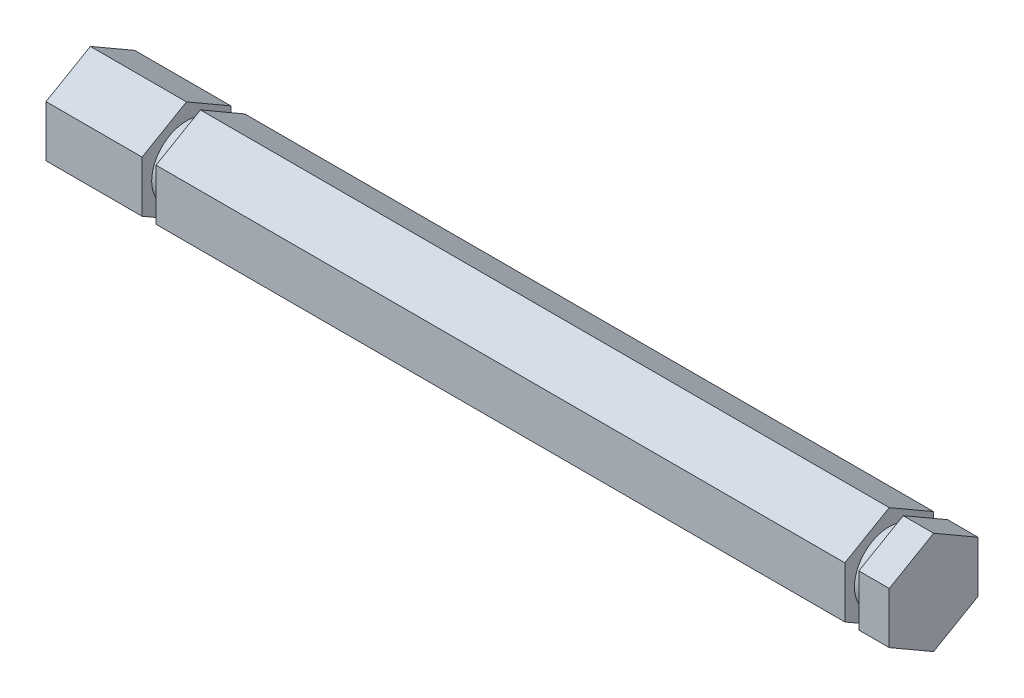
ISO-10303-21;
HEADER;
FILE_DESCRIPTION(('STEP AP214'),'2;1');
FILE_NAME('part.step','',(''),(''),'','','');
FILE_SCHEMA(('AUTOMOTIVE_DESIGN { 1 0 10303 214 1 1 1 1 }'));
ENDSEC;
DATA;
#1=APPLICATION_CONTEXT('core data for automotive mechanical design processes');
#2=APPLICATION_PROTOCOL_DEFINITION('international standard','automotive_design',2000,#1);
#3=PRODUCT_CONTEXT('',#1,'mechanical');
#4=PRODUCT('Part','Part','',(#3));
#5=PRODUCT_RELATED_PRODUCT_CATEGORY('part','',(#4));
#6=PRODUCT_DEFINITION_FORMATION('','',#4);
#7=PRODUCT_DEFINITION_CONTEXT('part definition',#1,'design');
#8=PRODUCT_DEFINITION('design','',#6,#7);
#9=PRODUCT_DEFINITION_SHAPE('','',#8);
#10=(LENGTH_UNIT() NAMED_UNIT(*) SI_UNIT(.MILLI.,.METRE.));
#11=(NAMED_UNIT(*) PLANE_ANGLE_UNIT() SI_UNIT($,.RADIAN.));
#12=(NAMED_UNIT(*) SI_UNIT($,.STERADIAN.) SOLID_ANGLE_UNIT());
#13=UNCERTAINTY_MEASURE_WITH_UNIT(LENGTH_MEASURE(1.E-05),#10,'distance_accuracy_value','');
#14=(GEOMETRIC_REPRESENTATION_CONTEXT(3) GLOBAL_UNCERTAINTY_ASSIGNED_CONTEXT((#13)) GLOBAL_UNIT_ASSIGNED_CONTEXT((#10,
#11,#12)) REPRESENTATION_CONTEXT('',''));
#15=CARTESIAN_POINT('',(0.,0.,0.));
#16=DIRECTION('',(0.,0.,1.));
#17=DIRECTION('',(1.,0.,0.));
#18=AXIS2_PLACEMENT_3D('',#15,#16,#17);
#19=CARTESIAN_POINT('',(120.65,3.6661742093542,-6.34999999999996));
#20=DIRECTION('',(0.,-0.866025403784441,0.499999999999995));
#21=DIRECTION('',(0.,-0.499999999999995,-0.866025403784442));
#22=AXIS2_PLACEMENT_3D('',#19,#20,#21);
#23=PLANE('',#22);
#24=DIRECTION('',(0.,-0.499999999999995,-0.866025403784442));
#25=VECTOR('',#24,1.);
#26=CARTESIAN_POINT('',(116.3,3.6661742093542,-6.34999999999996));
#27=LINE('',#26,#25);
#28=CARTESIAN_POINT('',(116.3,7.33234841870825,0.));
#29=VERTEX_POINT('',#28);
#30=CARTESIAN_POINT('',(116.3,3.6661742093542,-6.34999999999996));
#31=VERTEX_POINT('',#30);
#32=EDGE_CURVE('E366',#29,#31,#27,.T.);
#33=ORIENTED_EDGE('',*,*,#32,.F.);
#34=DIRECTION('',(-1.,0.,0.));
#35=VECTOR('',#34,1.);
#36=CARTESIAN_POINT('',(120.65,7.33234841870825,0.));
#37=LINE('',#36,#35);
#38=CARTESIAN_POINT('',(120.65,7.33234841870825,0.));
#39=VERTEX_POINT('',#38);
#40=EDGE_CURVE('E251',#39,#29,#37,.T.);
#41=ORIENTED_EDGE('',*,*,#40,.F.);
#42=DIRECTION('',(0.,0.499999999999995,0.866025403784441));
#43=VECTOR('',#42,1.);
#44=CARTESIAN_POINT('',(120.65,3.6661742093542,-6.34999999999996));
#45=LINE('',#44,#43);
#46=CARTESIAN_POINT('',(120.65,3.6661742093542,-6.34999999999996));
#47=VERTEX_POINT('',#46);
#48=EDGE_CURVE('E356',#47,#39,#45,.T.);
#49=ORIENTED_EDGE('',*,*,#48,.F.);
#50=DIRECTION('',(-1.,0.,0.));
#51=VECTOR('',#50,1.);
#52=CARTESIAN_POINT('',(120.65,3.6661742093542,-6.34999999999996));
#53=LINE('',#52,#51);
#54=EDGE_CURVE('E297',#47,#31,#53,.T.);
#55=ORIENTED_EDGE('',*,*,#54,.T.);
#56=EDGE_LOOP('',(#33,#41,#49,#55));
#57=FACE_BOUND('',#56,.T.);
#58=ADVANCED_FACE('F48',(#57),#23,.F.);
#59=CARTESIAN_POINT('',(120.65,7.33234841870825,0.));
#60=DIRECTION('',(0.,-0.866025403784438,-0.500000000000001));
#61=DIRECTION('',(0.,0.500000000000001,-0.866025403784438));
#62=AXIS2_PLACEMENT_3D('',#59,#60,#61);
#63=PLANE('',#62);
#64=DIRECTION('',(0.,0.500000000000001,-0.866025403784438));
#65=VECTOR('',#64,1.);
#66=CARTESIAN_POINT('',(116.3,7.33234841870825,0.));
#67=LINE('',#66,#65);
#68=CARTESIAN_POINT('',(116.3,3.66617420935411,6.35000000000001));
#69=VERTEX_POINT('',#68);
#70=EDGE_CURVE('E386',#69,#29,#67,.T.);
#71=ORIENTED_EDGE('',*,*,#70,.F.);
#72=DIRECTION('',(-1.,0.,0.));
#73=VECTOR('',#72,1.);
#74=CARTESIAN_POINT('',(120.65,3.66617420935411,6.35000000000001));
#75=LINE('',#74,#73);
#76=CARTESIAN_POINT('',(120.65,3.66617420935411,6.35000000000001));
#77=VERTEX_POINT('',#76);
#78=EDGE_CURVE('E230',#77,#69,#75,.T.);
#79=ORIENTED_EDGE('',*,*,#78,.F.);
#80=DIRECTION('',(0.,-0.500000000000001,0.866025403784438));
#81=VECTOR('',#80,1.);
#82=CARTESIAN_POINT('',(120.65,7.33234841870825,0.));
#83=LINE('',#82,#81);
#84=EDGE_CURVE('E378',#39,#77,#83,.T.);
#85=ORIENTED_EDGE('',*,*,#84,.F.);
#86=ORIENTED_EDGE('',*,*,#40,.T.);
#87=EDGE_LOOP('',(#71,#79,#85,#86));
#88=FACE_BOUND('',#87,.T.);
#89=ADVANCED_FACE('F464',(#88),#63,.F.);
#90=CARTESIAN_POINT('',(120.65,3.66617420935411,6.35000000000001));
#91=DIRECTION('',(0.,0.,-1.));
#92=DIRECTION('',(0.,1.,0.));
#93=AXIS2_PLACEMENT_3D('',#90,#91,#92);
#94=PLANE('',#93);
#95=DIRECTION('',(0.,1.,0.));
#96=VECTOR('',#95,1.);
#97=CARTESIAN_POINT('',(116.3,3.66617420935411,6.35000000000001));
#98=LINE('',#97,#96);
#99=CARTESIAN_POINT('',(116.3,-3.66617420935415,6.34999999999999));
#100=VERTEX_POINT('',#99);
#101=EDGE_CURVE('E389',#100,#69,#98,.T.);
#102=ORIENTED_EDGE('',*,*,#101,.F.);
#103=DIRECTION('',(-1.,0.,0.));
#104=VECTOR('',#103,1.);
#105=CARTESIAN_POINT('',(120.65,-3.66617420935416,6.34999999999999));
#106=LINE('',#105,#104);
#107=CARTESIAN_POINT('',(120.65,-3.66617420935416,6.34999999999999));
#108=VERTEX_POINT('',#107);
#109=EDGE_CURVE('E228',#108,#100,#106,.T.);
#110=ORIENTED_EDGE('',*,*,#109,.F.);
#111=DIRECTION('',(0.,-1.,0.));
#112=VECTOR('',#111,1.);
#113=CARTESIAN_POINT('',(120.65,3.66617420935411,6.35000000000001));
#114=LINE('',#113,#112);
#115=EDGE_CURVE('E375',#77,#108,#114,.T.);
#116=ORIENTED_EDGE('',*,*,#115,.F.);
#117=ORIENTED_EDGE('',*,*,#78,.T.);
#118=EDGE_LOOP('',(#102,#110,#116,#117));
#119=FACE_BOUND('',#118,.T.);
#120=ADVANCED_FACE('F471',(#119),#94,.F.);
#121=CARTESIAN_POINT('',(120.65,-3.66617420935416,6.34999999999999));
#122=DIRECTION('',(0.,0.866025403784442,-0.499999999999995));
#123=DIRECTION('',(0.,0.499999999999995,0.866025403784442));
#124=AXIS2_PLACEMENT_3D('',#121,#122,#123);
#125=PLANE('',#124);
#126=DIRECTION('',(0.,0.499999999999995,0.866025403784442));
#127=VECTOR('',#126,1.);
#128=CARTESIAN_POINT('',(116.3,-3.66617420935416,6.34999999999999));
#129=LINE('',#128,#127);
#130=CARTESIAN_POINT('',(116.3,-7.33234841870825,0.));
#131=VERTEX_POINT('',#130);
#132=EDGE_CURVE('E392',#131,#100,#129,.T.);
#133=ORIENTED_EDGE('',*,*,#132,.F.);
#134=DIRECTION('',(-1.,0.,0.));
#135=VECTOR('',#134,1.);
#136=CARTESIAN_POINT('',(120.65,-7.33234841870825,0.));
#137=LINE('',#136,#135);
#138=CARTESIAN_POINT('',(120.65,-7.33234841870825,0.));
#139=VERTEX_POINT('',#138);
#140=EDGE_CURVE('E317',#139,#131,#137,.T.);
#141=ORIENTED_EDGE('',*,*,#140,.F.);
#142=DIRECTION('',(0.,-0.499999999999995,-0.866025403784441));
#143=VECTOR('',#142,1.);
#144=CARTESIAN_POINT('',(120.65,-3.66617420935416,6.34999999999999));
#145=LINE('',#144,#143);
#146=EDGE_CURVE('E372',#108,#139,#145,.T.);
#147=ORIENTED_EDGE('',*,*,#146,.F.);
#148=ORIENTED_EDGE('',*,*,#109,.T.);
#149=EDGE_LOOP('',(#133,#141,#147,#148));
#150=FACE_BOUND('',#149,.T.);
#151=ADVANCED_FACE('F597',(#150),#125,.F.);
#152=CARTESIAN_POINT('',(120.65,-7.33234841870825,0.));
#153=DIRECTION('',(0.,0.866025403784435,0.500000000000007));
#154=DIRECTION('',(0.,-0.500000000000007,0.866025403784435));
#155=AXIS2_PLACEMENT_3D('',#152,#153,#154);
#156=PLANE('',#155);
#157=DIRECTION('',(0.,-0.500000000000007,0.866025403784435));
#158=VECTOR('',#157,1.);
#159=CARTESIAN_POINT('',(116.3,-7.33234841870825,0.));
#160=LINE('',#159,#158);
#161=CARTESIAN_POINT('',(116.3,-3.66617420935407,-6.35000000000004));
#162=VERTEX_POINT('',#161);
#163=EDGE_CURVE('E292',#162,#131,#160,.T.);
#164=ORIENTED_EDGE('',*,*,#163,.F.);
#165=DIRECTION('',(-1.,0.,0.));
#166=VECTOR('',#165,1.);
#167=CARTESIAN_POINT('',(120.65,-3.66617420935407,-6.35000000000004));
#168=LINE('',#167,#166);
#169=CARTESIAN_POINT('',(120.65,-3.66617420935407,-6.35000000000004));
#170=VERTEX_POINT('',#169);
#171=EDGE_CURVE('E311',#170,#162,#168,.T.);
#172=ORIENTED_EDGE('',*,*,#171,.F.);
#173=DIRECTION('',(0.,0.500000000000007,-0.866025403784435));
#174=VECTOR('',#173,1.);
#175=CARTESIAN_POINT('',(120.65,-7.33234841870825,0.));
#176=LINE('',#175,#174);
#177=EDGE_CURVE('E369',#139,#170,#176,.T.);
#178=ORIENTED_EDGE('',*,*,#177,.F.);
#179=ORIENTED_EDGE('',*,*,#140,.T.);
#180=EDGE_LOOP('',(#164,#172,#178,#179));
#181=FACE_BOUND('',#180,.T.);
#182=ADVANCED_FACE('F600',(#181),#156,.F.);
#183=CARTESIAN_POINT('',(120.65,-3.66617420935407,-6.35000000000004));
#184=DIRECTION('',(0.,0.,1.));
#185=DIRECTION('',(0.,-1.,0.));
#186=AXIS2_PLACEMENT_3D('',#183,#184,#185);
#187=PLANE('',#186);
#188=DIRECTION('',(0.,-1.,0.));
#189=VECTOR('',#188,1.);
#190=CARTESIAN_POINT('',(116.3,-3.66617420935407,-6.35000000000004));
#191=LINE('',#190,#189);
#192=EDGE_CURVE('E11',#31,#162,#191,.T.);
#193=ORIENTED_EDGE('',*,*,#192,.F.);
#194=ORIENTED_EDGE('',*,*,#54,.F.);
#195=DIRECTION('',(0.,1.,0.));
#196=VECTOR('',#195,1.);
#197=CARTESIAN_POINT('',(120.65,-3.66617420935407,-6.35000000000004));
#198=LINE('',#197,#196);
#199=EDGE_CURVE('E306',#170,#47,#198,.T.);
#200=ORIENTED_EDGE('',*,*,#199,.F.);
#201=ORIENTED_EDGE('',*,*,#171,.T.);
#202=EDGE_LOOP('',(#193,#194,#200,#201));
#203=FACE_BOUND('',#202,.T.);
#204=ADVANCED_FACE('F459',(#203),#187,.F.);
#205=CARTESIAN_POINT('',(120.65,0.,0.));
#206=DIRECTION('',(1.,0.,0.));
#207=DIRECTION('',(0.,0.,-1.));
#208=AXIS2_PLACEMENT_3D('',#205,#206,#207);
#209=PLANE('',#208);
#210=ORIENTED_EDGE('',*,*,#48,.T.);
#211=ORIENTED_EDGE('',*,*,#84,.T.);
#212=ORIENTED_EDGE('',*,*,#115,.T.);
#213=ORIENTED_EDGE('',*,*,#146,.T.);
#214=ORIENTED_EDGE('',*,*,#177,.T.);
#215=ORIENTED_EDGE('',*,*,#199,.T.);
#216=EDGE_LOOP('',(#210,#211,#212,#213,#214,#215));
#217=FACE_BOUND('',#216,.T.);
#218=ADVANCED_FACE('F605',(#217),#209,.T.);
#219=CARTESIAN_POINT('',(116.3,7.33234841870825,0.));
#220=DIRECTION('',(-1.,0.,0.));
#221=DIRECTION('',(0.,0.,1.));
#222=AXIS2_PLACEMENT_3D('',#219,#220,#221);
#223=PLANE('',#222);
#224=CARTESIAN_POINT('',(116.3,0.,0.));
#225=DIRECTION('',(-1.,0.,0.));
#226=DIRECTION('',(0.,0.,1.));
#227=AXIS2_PLACEMENT_3D('',#224,#225,#226);
#228=CIRCLE('',#227,4.9784);
#229=CARTESIAN_POINT('',(116.3,0.,4.9784));
#230=VERTEX_POINT('',#229);
#231=EDGE_CURVE('E428',#230,#230,#228,.T.);
#232=ORIENTED_EDGE('',*,*,#231,.F.);
#233=EDGE_LOOP('',(#232));
#234=FACE_BOUND('',#233,.T.);
#235=ORIENTED_EDGE('',*,*,#32,.T.);
#236=ORIENTED_EDGE('',*,*,#192,.T.);
#237=ORIENTED_EDGE('',*,*,#163,.T.);
#238=ORIENTED_EDGE('',*,*,#132,.T.);
#239=ORIENTED_EDGE('',*,*,#101,.T.);
#240=ORIENTED_EDGE('',*,*,#70,.T.);
#241=EDGE_LOOP('',(#235,#236,#237,#238,#239,#240));
#242=FACE_BOUND('',#241,.T.);
#243=ADVANCED_FACE('F460',(#234,#242),#223,.T.);
#244=CARTESIAN_POINT('',(114.3,7.33234841870825,0.));
#245=DIRECTION('',(1.,0.,0.));
#246=DIRECTION('',(0.,0.,-1.));
#247=AXIS2_PLACEMENT_3D('',#244,#245,#246);
#248=PLANE('',#247);
#249=CARTESIAN_POINT('',(114.3,0.,0.));
#250=DIRECTION('',(-1.,0.,0.));
#251=DIRECTION('',(0.,0.,1.));
#252=AXIS2_PLACEMENT_3D('',#249,#250,#251);
#253=CIRCLE('',#252,4.9784);
#254=CARTESIAN_POINT('',(114.3,0.,4.9784));
#255=VERTEX_POINT('',#254);
#256=EDGE_CURVE('E433',#255,#255,#253,.T.);
#257=ORIENTED_EDGE('',*,*,#256,.T.);
#258=EDGE_LOOP('',(#257));
#259=FACE_BOUND('',#258,.T.);
#260=DIRECTION('',(0.,0.499999999999995,0.866025403784442));
#261=VECTOR('',#260,1.);
#262=CARTESIAN_POINT('',(114.3,3.6661742093542,-6.34999999999996));
#263=LINE('',#262,#261);
#264=CARTESIAN_POINT('',(114.3,3.6661742093542,-6.34999999999996));
#265=VERTEX_POINT('',#264);
#266=CARTESIAN_POINT('',(114.3,7.33234841870825,0.));
#267=VERTEX_POINT('',#266);
#268=EDGE_CURVE('E279',#265,#267,#263,.T.);
#269=ORIENTED_EDGE('',*,*,#268,.T.);
#270=DIRECTION('',(0.,-0.500000000000001,0.866025403784438));
#271=VECTOR('',#270,1.);
#272=CARTESIAN_POINT('',(114.3,7.33234841870825,0.));
#273=LINE('',#272,#271);
#274=CARTESIAN_POINT('',(114.3,3.66617420935411,6.35000000000001));
#275=VERTEX_POINT('',#274);
#276=EDGE_CURVE('E293',#267,#275,#273,.T.);
#277=ORIENTED_EDGE('',*,*,#276,.T.);
#278=DIRECTION('',(0.,-1.,0.));
#279=VECTOR('',#278,1.);
#280=CARTESIAN_POINT('',(114.3,3.66617420935411,6.35000000000001));
#281=LINE('',#280,#279);
#282=CARTESIAN_POINT('',(114.3,-3.66617420935415,6.34999999999999));
#283=VERTEX_POINT('',#282);
#284=EDGE_CURVE('E399',#275,#283,#281,.T.);
#285=ORIENTED_EDGE('',*,*,#284,.T.);
#286=DIRECTION('',(0.,-0.499999999999995,-0.866025403784442));
#287=VECTOR('',#286,1.);
#288=CARTESIAN_POINT('',(114.3,-3.66617420935416,6.34999999999999));
#289=LINE('',#288,#287);
#290=CARTESIAN_POINT('',(114.3,-7.33234841870825,0.));
#291=VERTEX_POINT('',#290);
#292=EDGE_CURVE('E402',#283,#291,#289,.T.);
#293=ORIENTED_EDGE('',*,*,#292,.T.);
#294=DIRECTION('',(0.,0.500000000000007,-0.866025403784435));
#295=VECTOR('',#294,1.);
#296=CARTESIAN_POINT('',(114.3,-7.33234841870825,0.));
#297=LINE('',#296,#295);
#298=CARTESIAN_POINT('',(114.3,-3.66617420935407,-6.35000000000004));
#299=VERTEX_POINT('',#298);
#300=EDGE_CURVE('E77',#291,#299,#297,.T.);
#301=ORIENTED_EDGE('',*,*,#300,.T.);
#302=DIRECTION('',(0.,1.,0.));
#303=VECTOR('',#302,1.);
#304=CARTESIAN_POINT('',(114.3,-3.66617420935407,-6.35000000000004));
#305=LINE('',#304,#303);
#306=EDGE_CURVE('E56',#299,#265,#305,.T.);
#307=ORIENTED_EDGE('',*,*,#306,.T.);
#308=EDGE_LOOP('',(#269,#277,#285,#293,#301,#307));
#309=FACE_BOUND('',#308,.T.);
#310=ADVANCED_FACE('F278',(#259,#309),#248,.T.);
#311=CARTESIAN_POINT('',(0.,0.,0.));
#312=DIRECTION('',(-1.,0.,0.));
#313=DIRECTION('',(0.,0.,1.));
#314=AXIS2_PLACEMENT_3D('',#311,#312,#313);
#315=CYLINDRICAL_SURFACE('',#314,4.9784);
#316=ORIENTED_EDGE('',*,*,#231,.T.);
#317=EDGE_LOOP('',(#316));
#318=FACE_BOUND('',#317,.T.);
#319=ORIENTED_EDGE('',*,*,#256,.F.);
#320=EDGE_LOOP('',(#319));
#321=FACE_BOUND('',#320,.T.);
#322=ADVANCED_FACE('F448',(#318,#321),#315,.T.);
#323=ORIENTED_EDGE('',*,*,#306,.F.);
#324=CARTESIAN_POINT('',(15.748,-3.66617420935407,-6.35000000000004));
#325=VERTEX_POINT('',#324);
#326=EDGE_CURVE('E316',#299,#325,#168,.T.);
#327=ORIENTED_EDGE('',*,*,#326,.T.);
#328=DIRECTION('',(0.,-1.,0.));
#329=VECTOR('',#328,1.);
#330=CARTESIAN_POINT('',(15.748,-3.66617420935407,-6.35000000000004));
#331=LINE('',#330,#329);
#332=CARTESIAN_POINT('',(15.748,3.6661742093542,-6.34999999999996));
#333=VERTEX_POINT('',#332);
#334=EDGE_CURVE('E259',#333,#325,#331,.T.);
#335=ORIENTED_EDGE('',*,*,#334,.F.);
#336=EDGE_CURVE('E290',#265,#333,#53,.T.);
#337=ORIENTED_EDGE('',*,*,#336,.F.);
#338=EDGE_LOOP('',(#323,#327,#335,#337));
#339=FACE_BOUND('',#338,.T.);
#340=ADVANCED_FACE('F295',(#339),#187,.F.);
#341=ORIENTED_EDGE('',*,*,#300,.F.);
#342=CARTESIAN_POINT('',(15.748,-7.33234841870825,0.));
#343=VERTEX_POINT('',#342);
#344=EDGE_CURVE('E320',#291,#343,#137,.T.);
#345=ORIENTED_EDGE('',*,*,#344,.T.);
#346=DIRECTION('',(0.,-0.500000000000007,0.866025403784435));
#347=VECTOR('',#346,1.);
#348=CARTESIAN_POINT('',(15.748,-7.33234841870825,0.));
#349=LINE('',#348,#347);
#350=EDGE_CURVE('E425',#325,#343,#349,.T.);
#351=ORIENTED_EDGE('',*,*,#350,.F.);
#352=ORIENTED_EDGE('',*,*,#326,.F.);
#353=EDGE_LOOP('',(#341,#345,#351,#352));
#354=FACE_BOUND('',#353,.T.);
#355=ADVANCED_FACE('F456',(#354),#156,.F.);
#356=ORIENTED_EDGE('',*,*,#292,.F.);
#357=CARTESIAN_POINT('',(15.748,-3.66617420935415,6.34999999999999));
#358=VERTEX_POINT('',#357);
#359=EDGE_CURVE('E237',#283,#358,#106,.T.);
#360=ORIENTED_EDGE('',*,*,#359,.T.);
#361=DIRECTION('',(0.,0.499999999999995,0.866025403784442));
#362=VECTOR('',#361,1.);
#363=CARTESIAN_POINT('',(15.748,-3.66617420935416,6.34999999999999));
#364=LINE('',#363,#362);
#365=EDGE_CURVE('E422',#343,#358,#364,.T.);
#366=ORIENTED_EDGE('',*,*,#365,.F.);
#367=ORIENTED_EDGE('',*,*,#344,.F.);
#368=EDGE_LOOP('',(#356,#360,#366,#367));
#369=FACE_BOUND('',#368,.T.);
#370=ADVANCED_FACE('F496',(#369),#125,.F.);
#371=ORIENTED_EDGE('',*,*,#284,.F.);
#372=CARTESIAN_POINT('',(15.748,3.66617420935411,6.35000000000001));
#373=VERTEX_POINT('',#372);
#374=EDGE_CURVE('E227',#275,#373,#75,.T.);
#375=ORIENTED_EDGE('',*,*,#374,.T.);
#376=DIRECTION('',(0.,1.,0.));
#377=VECTOR('',#376,1.);
#378=CARTESIAN_POINT('',(15.748,3.66617420935411,6.35000000000001));
#379=LINE('',#378,#377);
#380=EDGE_CURVE('E419',#358,#373,#379,.T.);
#381=ORIENTED_EDGE('',*,*,#380,.F.);
#382=ORIENTED_EDGE('',*,*,#359,.F.);
#383=EDGE_LOOP('',(#371,#375,#381,#382));
#384=FACE_BOUND('',#383,.T.);
#385=ADVANCED_FACE('F586',(#384),#94,.F.);
#386=ORIENTED_EDGE('',*,*,#276,.F.);
#387=CARTESIAN_POINT('',(15.748,7.33234841870825,0.));
#388=VERTEX_POINT('',#387);
#389=EDGE_CURVE('E250',#267,#388,#37,.T.);
#390=ORIENTED_EDGE('',*,*,#389,.T.);
#391=DIRECTION('',(0.,0.500000000000001,-0.866025403784438));
#392=VECTOR('',#391,1.);
#393=CARTESIAN_POINT('',(15.748,7.33234841870825,0.));
#394=LINE('',#393,#392);
#395=EDGE_CURVE('E416',#373,#388,#394,.T.);
#396=ORIENTED_EDGE('',*,*,#395,.F.);
#397=ORIENTED_EDGE('',*,*,#374,.F.);
#398=EDGE_LOOP('',(#386,#390,#396,#397));
#399=FACE_BOUND('',#398,.T.);
#400=ADVANCED_FACE('F472',(#399),#63,.F.);
#401=ORIENTED_EDGE('',*,*,#268,.F.);
#402=ORIENTED_EDGE('',*,*,#336,.T.);
#403=DIRECTION('',(0.,-0.499999999999995,-0.866025403784442));
#404=VECTOR('',#403,1.);
#405=CARTESIAN_POINT('',(15.748,3.6661742093542,-6.34999999999996));
#406=LINE('',#405,#404);
#407=EDGE_CURVE('E413',#388,#333,#406,.T.);
#408=ORIENTED_EDGE('',*,*,#407,.F.);
#409=ORIENTED_EDGE('',*,*,#389,.F.);
#410=EDGE_LOOP('',(#401,#402,#408,#409));
#411=FACE_BOUND('',#410,.T.);
#412=ADVANCED_FACE('F288',(#411),#23,.F.);
#413=CARTESIAN_POINT('',(13.748,7.33234841870825,0.));
#414=DIRECTION('',(1.,0.,0.));
#415=DIRECTION('',(0.,0.,-1.));
#416=AXIS2_PLACEMENT_3D('',#413,#414,#415);
#417=PLANE('',#416);
#418=CARTESIAN_POINT('',(13.748,0.,0.));
#419=DIRECTION('',(-1.,0.,0.));
#420=DIRECTION('',(0.,0.,1.));
#421=AXIS2_PLACEMENT_3D('',#418,#419,#420);
#422=CIRCLE('',#421,4.97839999999999);
#423=CARTESIAN_POINT('',(13.748,0.,4.97839999999999));
#424=VERTEX_POINT('',#423);
#425=EDGE_CURVE('E429',#424,#424,#422,.T.);
#426=ORIENTED_EDGE('',*,*,#425,.T.);
#427=EDGE_LOOP('',(#426));
#428=FACE_BOUND('',#427,.T.);
#429=DIRECTION('',(0.,0.499999999999995,0.866025403784442));
#430=VECTOR('',#429,1.);
#431=CARTESIAN_POINT('',(13.748,3.6661742093542,-6.34999999999996));
#432=LINE('',#431,#430);
#433=CARTESIAN_POINT('',(13.748,3.6661742093542,-6.34999999999996));
#434=VERTEX_POINT('',#433);
#435=CARTESIAN_POINT('',(13.748,7.33234841870825,0.));
#436=VERTEX_POINT('',#435);
#437=EDGE_CURVE('E206',#434,#436,#432,.T.);
#438=ORIENTED_EDGE('',*,*,#437,.T.);
#439=DIRECTION('',(0.,-0.500000000000001,0.866025403784438));
#440=VECTOR('',#439,1.);
#441=CARTESIAN_POINT('',(13.748,7.33234841870825,0.));
#442=LINE('',#441,#440);
#443=CARTESIAN_POINT('',(13.748,3.66617420935411,6.35000000000001));
#444=VERTEX_POINT('',#443);
#445=EDGE_CURVE('E200',#436,#444,#442,.T.);
#446=ORIENTED_EDGE('',*,*,#445,.T.);
#447=DIRECTION('',(0.,-1.,0.));
#448=VECTOR('',#447,1.);
#449=CARTESIAN_POINT('',(13.748,3.66617420935411,6.35000000000001));
#450=LINE('',#449,#448);
#451=CARTESIAN_POINT('',(13.748,-3.66617420935415,6.34999999999999));
#452=VERTEX_POINT('',#451);
#453=EDGE_CURVE('E203',#444,#452,#450,.T.);
#454=ORIENTED_EDGE('',*,*,#453,.T.);
#455=DIRECTION('',(0.,-0.499999999999995,-0.866025403784442));
#456=VECTOR('',#455,1.);
#457=CARTESIAN_POINT('',(13.748,-3.66617420935416,6.34999999999999));
#458=LINE('',#457,#456);
#459=CARTESIAN_POINT('',(13.748,-7.33234841870825,0.));
#460=VERTEX_POINT('',#459);
#461=EDGE_CURVE('E220',#452,#460,#458,.T.);
#462=ORIENTED_EDGE('',*,*,#461,.T.);
#463=DIRECTION('',(0.,0.500000000000007,-0.866025403784435));
#464=VECTOR('',#463,1.);
#465=CARTESIAN_POINT('',(13.748,-7.33234841870825,0.));
#466=LINE('',#465,#464);
#467=CARTESIAN_POINT('',(13.748,-3.66617420935407,-6.35000000000004));
#468=VERTEX_POINT('',#467);
#469=EDGE_CURVE('E66',#460,#468,#466,.T.);
#470=ORIENTED_EDGE('',*,*,#469,.T.);
#471=DIRECTION('',(0.,1.,0.));
#472=VECTOR('',#471,1.);
#473=CARTESIAN_POINT('',(13.748,-3.66617420935407,-6.35000000000004));
#474=LINE('',#473,#472);
#475=EDGE_CURVE('E266',#468,#434,#474,.T.);
#476=ORIENTED_EDGE('',*,*,#475,.T.);
#477=EDGE_LOOP('',(#438,#446,#454,#462,#470,#476));
#478=FACE_BOUND('',#477,.T.);
#479=ADVANCED_FACE('F202',(#428,#478),#417,.T.);
#480=CARTESIAN_POINT('',(15.748,7.33234841870825,0.));
#481=DIRECTION('',(-1.,0.,0.));
#482=DIRECTION('',(0.,0.,1.));
#483=AXIS2_PLACEMENT_3D('',#480,#481,#482);
#484=PLANE('',#483);
#485=CARTESIAN_POINT('',(15.748,0.,0.));
#486=DIRECTION('',(-1.,0.,0.));
#487=DIRECTION('',(0.,0.,1.));
#488=AXIS2_PLACEMENT_3D('',#485,#486,#487);
#489=CIRCLE('',#488,4.97839999999999);
#490=CARTESIAN_POINT('',(15.748,0.,4.97839999999999));
#491=VERTEX_POINT('',#490);
#492=EDGE_CURVE('E434',#491,#491,#489,.T.);
#493=ORIENTED_EDGE('',*,*,#492,.F.);
#494=EDGE_LOOP('',(#493));
#495=FACE_BOUND('',#494,.T.);
#496=ORIENTED_EDGE('',*,*,#407,.T.);
#497=ORIENTED_EDGE('',*,*,#334,.T.);
#498=ORIENTED_EDGE('',*,*,#350,.T.);
#499=ORIENTED_EDGE('',*,*,#365,.T.);
#500=ORIENTED_EDGE('',*,*,#380,.T.);
#501=ORIENTED_EDGE('',*,*,#395,.T.);
#502=EDGE_LOOP('',(#496,#497,#498,#499,#500,#501));
#503=FACE_BOUND('',#502,.T.);
#504=ADVANCED_FACE('F491',(#495,#503),#484,.T.);
#505=CARTESIAN_POINT('',(0.,0.,0.));
#506=DIRECTION('',(-1.,0.,0.));
#507=DIRECTION('',(0.,0.,1.));
#508=AXIS2_PLACEMENT_3D('',#505,#506,#507);
#509=CYLINDRICAL_SURFACE('',#508,4.97839999999999);
#510=ORIENTED_EDGE('',*,*,#492,.T.);
#511=EDGE_LOOP('',(#510));
#512=FACE_BOUND('',#511,.T.);
#513=ORIENTED_EDGE('',*,*,#425,.F.);
#514=EDGE_LOOP('',(#513));
#515=FACE_BOUND('',#514,.T.);
#516=ADVANCED_FACE('F608',(#512,#515),#509,.T.);
#517=CARTESIAN_POINT('',(0.,0.,0.));
#518=DIRECTION('',(1.,0.,0.));
#519=DIRECTION('',(0.,0.,-1.));
#520=AXIS2_PLACEMENT_3D('',#517,#518,#519);
#521=PLANE('',#520);
#522=DIRECTION('',(0.,0.499999999999995,0.866025403784441));
#523=VECTOR('',#522,1.);
#524=CARTESIAN_POINT('',(0.,3.6661742093542,-6.34999999999996));
#525=LINE('',#524,#523);
#526=CARTESIAN_POINT('',(0.,3.6661742093542,-6.34999999999996));
#527=VERTEX_POINT('',#526);
#528=CARTESIAN_POINT('',(0.,7.33234841870825,0.));
#529=VERTEX_POINT('',#528);
#530=EDGE_CURVE('E362',#527,#529,#525,.T.);
#531=ORIENTED_EDGE('',*,*,#530,.F.);
#532=DIRECTION('',(0.,1.,0.));
#533=VECTOR('',#532,1.);
#534=CARTESIAN_POINT('',(0.,-3.66617420935407,-6.35000000000004));
#535=LINE('',#534,#533);
#536=CARTESIAN_POINT('',(0.,-3.66617420935407,-6.35000000000004));
#537=VERTEX_POINT('',#536);
#538=EDGE_CURVE('E309',#537,#527,#535,.T.);
#539=ORIENTED_EDGE('',*,*,#538,.F.);
#540=DIRECTION('',(0.,0.500000000000007,-0.866025403784435));
#541=VECTOR('',#540,1.);
#542=CARTESIAN_POINT('',(0.,-7.33234841870825,0.));
#543=LINE('',#542,#541);
#544=CARTESIAN_POINT('',(0.,-7.33234841870825,0.));
#545=VERTEX_POINT('',#544);
#546=EDGE_CURVE('E340',#545,#537,#543,.T.);
#547=ORIENTED_EDGE('',*,*,#546,.F.);
#548=DIRECTION('',(0.,-0.499999999999995,-0.866025403784441));
#549=VECTOR('',#548,1.);
#550=CARTESIAN_POINT('',(0.,-3.66617420935416,6.34999999999999));
#551=LINE('',#550,#549);
#552=CARTESIAN_POINT('',(0.,-3.66617420935416,6.34999999999999));
#553=VERTEX_POINT('',#552);
#554=EDGE_CURVE('E344',#553,#545,#551,.T.);
#555=ORIENTED_EDGE('',*,*,#554,.F.);
#556=DIRECTION('',(0.,-1.,0.));
#557=VECTOR('',#556,1.);
#558=CARTESIAN_POINT('',(0.,3.66617420935411,6.35000000000001));
#559=LINE('',#558,#557);
#560=CARTESIAN_POINT('',(0.,3.66617420935411,6.35000000000001));
#561=VERTEX_POINT('',#560);
#562=EDGE_CURVE('E348',#561,#553,#559,.T.);
#563=ORIENTED_EDGE('',*,*,#562,.F.);
#564=DIRECTION('',(0.,-0.500000000000001,0.866025403784438));
#565=VECTOR('',#564,1.);
#566=CARTESIAN_POINT('',(0.,7.33234841870825,0.));
#567=LINE('',#566,#565);
#568=EDGE_CURVE('E224',#529,#561,#567,.T.);
#569=ORIENTED_EDGE('',*,*,#568,.F.);
#570=EDGE_LOOP('',(#531,#539,#547,#555,#563,#569));
#571=FACE_BOUND('',#570,.T.);
#572=ADVANCED_FACE('F351',(#571),#521,.F.);
#573=ORIENTED_EDGE('',*,*,#475,.F.);
#574=EDGE_CURVE('E305',#468,#537,#168,.T.);
#575=ORIENTED_EDGE('',*,*,#574,.T.);
#576=ORIENTED_EDGE('',*,*,#538,.T.);
#577=EDGE_CURVE('E298',#434,#527,#53,.T.);
#578=ORIENTED_EDGE('',*,*,#577,.F.);
#579=EDGE_LOOP('',(#573,#575,#576,#578));
#580=FACE_BOUND('',#579,.T.);
#581=ADVANCED_FACE('F458',(#580),#187,.F.);
#582=ORIENTED_EDGE('',*,*,#469,.F.);
#583=EDGE_CURVE('E315',#460,#545,#137,.T.);
#584=ORIENTED_EDGE('',*,*,#583,.T.);
#585=ORIENTED_EDGE('',*,*,#546,.T.);
#586=ORIENTED_EDGE('',*,*,#574,.F.);
#587=EDGE_LOOP('',(#582,#584,#585,#586));
#588=FACE_BOUND('',#587,.T.);
#589=ADVANCED_FACE('F337',(#588),#156,.F.);
#590=ORIENTED_EDGE('',*,*,#461,.F.);
#591=EDGE_CURVE('E218',#452,#553,#106,.T.);
#592=ORIENTED_EDGE('',*,*,#591,.T.);
#593=ORIENTED_EDGE('',*,*,#554,.T.);
#594=ORIENTED_EDGE('',*,*,#583,.F.);
#595=EDGE_LOOP('',(#590,#592,#593,#594));
#596=FACE_BOUND('',#595,.T.);
#597=ADVANCED_FACE('F345',(#596),#125,.F.);
#598=ORIENTED_EDGE('',*,*,#453,.F.);
#599=EDGE_CURVE('E216',#444,#561,#75,.T.);
#600=ORIENTED_EDGE('',*,*,#599,.T.);
#601=ORIENTED_EDGE('',*,*,#562,.T.);
#602=ORIENTED_EDGE('',*,*,#591,.F.);
#603=EDGE_LOOP('',(#598,#600,#601,#602));
#604=FACE_BOUND('',#603,.T.);
#605=ADVANCED_FACE('F214',(#604),#94,.F.);
#606=ORIENTED_EDGE('',*,*,#445,.F.);
#607=EDGE_CURVE('E242',#436,#529,#37,.T.);
#608=ORIENTED_EDGE('',*,*,#607,.T.);
#609=ORIENTED_EDGE('',*,*,#568,.T.);
#610=ORIENTED_EDGE('',*,*,#599,.F.);
#611=EDGE_LOOP('',(#606,#608,#609,#610));
#612=FACE_BOUND('',#611,.T.);
#613=ADVANCED_FACE('F222',(#612),#63,.F.);
#614=ORIENTED_EDGE('',*,*,#437,.F.);
#615=ORIENTED_EDGE('',*,*,#577,.T.);
#616=ORIENTED_EDGE('',*,*,#530,.T.);
#617=ORIENTED_EDGE('',*,*,#607,.F.);
#618=EDGE_LOOP('',(#614,#615,#616,#617));
#619=FACE_BOUND('',#618,.T.);
#620=ADVANCED_FACE('F466',(#619),#23,.F.);
#621=CLOSED_SHELL('',(#58,#89,#120,#151,#182,#204,#218,#243,#310,#322,#340,#355,#370,#385,#400,
#412,#479,#504,#516,#572,#581,#589,#597,#605,#613,#620));
#622=MANIFOLD_SOLID_BREP('B2',#621);
#623=ADVANCED_BREP_SHAPE_REPRESENTATION('',(#18,#622),#14);
#624=SHAPE_DEFINITION_REPRESENTATION(#9,#623);
ENDSEC;
END-ISO-10303-21;
